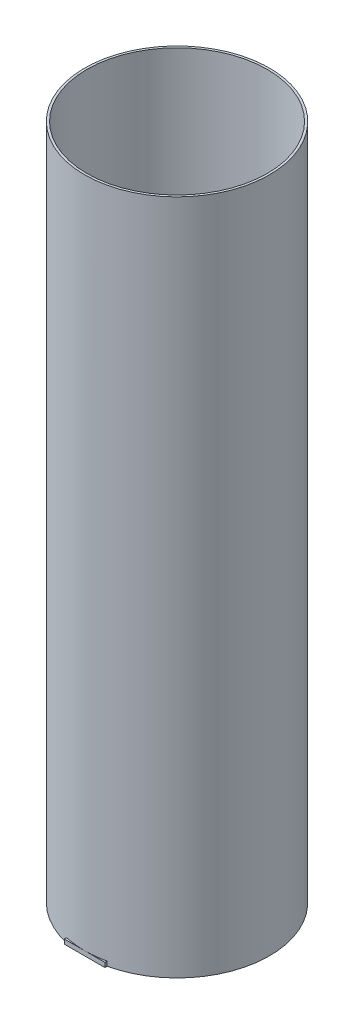
ISO-10303-21;
HEADER;
FILE_DESCRIPTION(('STEP AP214'),'2;1');
FILE_NAME('part.step','',(''),(''),'','','');
FILE_SCHEMA(('AUTOMOTIVE_DESIGN { 1 0 10303 214 1 1 1 1 }'));
ENDSEC;
DATA;
#1=APPLICATION_CONTEXT('core data for automotive mechanical design processes');
#2=APPLICATION_PROTOCOL_DEFINITION('international standard','automotive_design',2000,#1);
#3=PRODUCT_CONTEXT('',#1,'mechanical');
#4=PRODUCT('Part','Part','',(#3));
#5=PRODUCT_RELATED_PRODUCT_CATEGORY('part','',(#4));
#6=PRODUCT_DEFINITION_FORMATION('','',#4);
#7=PRODUCT_DEFINITION_CONTEXT('part definition',#1,'design');
#8=PRODUCT_DEFINITION('design','',#6,#7);
#9=PRODUCT_DEFINITION_SHAPE('','',#8);
#10=(LENGTH_UNIT() NAMED_UNIT(*) SI_UNIT(.MILLI.,.METRE.));
#11=(NAMED_UNIT(*) PLANE_ANGLE_UNIT() SI_UNIT($,.RADIAN.));
#12=(NAMED_UNIT(*) SI_UNIT($,.STERADIAN.) SOLID_ANGLE_UNIT());
#13=UNCERTAINTY_MEASURE_WITH_UNIT(LENGTH_MEASURE(1.E-05),#10,'distance_accuracy_value','');
#14=(GEOMETRIC_REPRESENTATION_CONTEXT(3) GLOBAL_UNCERTAINTY_ASSIGNED_CONTEXT((#13)) GLOBAL_UNIT_ASSIGNED_CONTEXT((#10,
#11,#12)) REPRESENTATION_CONTEXT('',''));
#15=CARTESIAN_POINT('',(0.,0.,0.));
#16=DIRECTION('',(0.,0.,1.));
#17=DIRECTION('',(1.,0.,0.));
#18=AXIS2_PLACEMENT_3D('',#15,#16,#17);
#19=CARTESIAN_POINT('',(0.,381.,0.));
#20=DIRECTION('',(0.,1.,0.));
#21=DIRECTION('',(0.,0.,1.));
#22=AXIS2_PLACEMENT_3D('',#19,#20,#21);
#23=PLANE('',#22);
#24=CARTESIAN_POINT('',(0.,381.,0.));
#25=DIRECTION('',(0.,1.,0.));
#26=DIRECTION('',(0.,0.,1.));
#27=AXIS2_PLACEMENT_3D('',#24,#25,#26);
#28=CIRCLE('',#27,52.07);
#29=CARTESIAN_POINT('',(0.,381.,52.07));
#30=VERTEX_POINT('',#29);
#31=EDGE_CURVE('E11',#30,#30,#28,.T.);
#32=ORIENTED_EDGE('',*,*,#31,.T.);
#33=EDGE_LOOP('',(#32));
#34=FACE_BOUND('',#33,.T.);
#35=CARTESIAN_POINT('',(0.,381.,0.));
#36=DIRECTION('',(0.,1.,0.));
#37=DIRECTION('',(0.,0.,1.));
#38=AXIS2_PLACEMENT_3D('',#35,#36,#37);
#39=CIRCLE('',#38,50.8);
#40=CARTESIAN_POINT('',(0.,381.,50.8));
#41=VERTEX_POINT('',#40);
#42=EDGE_CURVE('E125',#41,#41,#39,.T.);
#43=ORIENTED_EDGE('',*,*,#42,.F.);
#44=EDGE_LOOP('',(#43));
#45=FACE_BOUND('',#44,.T.);
#46=ADVANCED_FACE('F45',(#34,#45),#23,.T.);
#47=CARTESIAN_POINT('',(0.,0.,0.));
#48=DIRECTION('',(0.,1.,0.));
#49=DIRECTION('',(0.,0.,1.));
#50=AXIS2_PLACEMENT_3D('',#47,#48,#49);
#51=PLANE('',#50);
#52=CARTESIAN_POINT('',(0.,0.,0.));
#53=DIRECTION('',(0.,1.,0.));
#54=DIRECTION('',(0.,0.,1.));
#55=AXIS2_PLACEMENT_3D('',#52,#53,#54);
#56=CIRCLE('',#55,50.8);
#57=CARTESIAN_POINT('',(0.,0.,50.8));
#58=VERTEX_POINT('',#57);
#59=EDGE_CURVE('E128',#58,#58,#56,.T.);
#60=ORIENTED_EDGE('',*,*,#59,.T.);
#61=EDGE_LOOP('',(#60));
#62=FACE_BOUND('',#61,.T.);
#63=CARTESIAN_POINT('',(0.,0.,0.));
#64=DIRECTION('',(0.,1.,0.));
#65=DIRECTION('',(0.,0.,1.));
#66=AXIS2_PLACEMENT_3D('',#63,#64,#65);
#67=CIRCLE('',#66,52.07);
#68=CARTESIAN_POINT('',(11.4299999999999,0.,50.8));
#69=VERTEX_POINT('',#68);
#70=CARTESIAN_POINT('',(-11.4299999999999,0.,50.8));
#71=VERTEX_POINT('',#70);
#72=EDGE_CURVE('E49',#69,#71,#67,.T.);
#73=ORIENTED_EDGE('',*,*,#72,.F.);
#74=DIRECTION('',(0.,0.,1.));
#75=VECTOR('',#74,1.);
#76=CARTESIAN_POINT('',(11.4299999999999,0.,0.));
#77=LINE('',#76,#75);
#78=CARTESIAN_POINT('',(11.4299999999999,0.,52.07));
#79=VERTEX_POINT('',#78);
#80=EDGE_CURVE('E117',#69,#79,#77,.T.);
#81=ORIENTED_EDGE('',*,*,#80,.T.);
#82=DIRECTION('',(-1.,0.,0.));
#83=VECTOR('',#82,1.);
#84=CARTESIAN_POINT('',(0.,0.,52.07));
#85=LINE('',#84,#83);
#86=CARTESIAN_POINT('',(-11.4299999999999,0.,52.07));
#87=VERTEX_POINT('',#86);
#88=EDGE_CURVE('E93',#79,#87,#85,.T.);
#89=ORIENTED_EDGE('',*,*,#88,.T.);
#90=DIRECTION('',(0.,0.,-1.));
#91=VECTOR('',#90,1.);
#92=CARTESIAN_POINT('',(-11.4299999999999,0.,0.));
#93=LINE('',#92,#91);
#94=EDGE_CURVE('E110',#87,#71,#93,.T.);
#95=ORIENTED_EDGE('',*,*,#94,.T.);
#96=EDGE_LOOP('',(#73,#81,#89,#95));
#97=FACE_BOUND('',#96,.T.);
#98=ADVANCED_FACE('F132',(#62,#97),#51,.F.);
#99=CARTESIAN_POINT('',(0.,381.,0.));
#100=DIRECTION('',(0.,-1.,0.));
#101=DIRECTION('',(0.,0.,-1.));
#102=AXIS2_PLACEMENT_3D('',#99,#100,#101);
#103=CYLINDRICAL_SURFACE('',#102,52.07);
#104=ORIENTED_EDGE('',*,*,#31,.F.);
#105=EDGE_LOOP('',(#104));
#106=FACE_BOUND('',#105,.T.);
#107=CARTESIAN_POINT('',(0.,2.53999999999999,0.));
#108=DIRECTION('',(0.,-1.,0.));
#109=DIRECTION('',(0.,0.,-1.));
#110=AXIS2_PLACEMENT_3D('',#107,#108,#109);
#111=CIRCLE('',#110,52.07);
#112=CARTESIAN_POINT('',(11.4299999999999,2.53999999999999,50.8));
#113=VERTEX_POINT('',#112);
#114=CARTESIAN_POINT('',(0.,2.53999999999999,52.07));
#115=VERTEX_POINT('',#114);
#116=EDGE_CURVE('E60',#113,#115,#111,.T.);
#117=ORIENTED_EDGE('',*,*,#116,.F.);
#118=DIRECTION('',(0.,-1.,0.));
#119=VECTOR('',#118,1.);
#120=CARTESIAN_POINT('',(11.4299999999999,2.54,50.8));
#121=LINE('',#120,#119);
#122=EDGE_CURVE('E109',#113,#69,#121,.T.);
#123=ORIENTED_EDGE('',*,*,#122,.T.);
#124=ORIENTED_EDGE('',*,*,#72,.T.);
#125=DIRECTION('',(0.,-1.,0.));
#126=VECTOR('',#125,1.);
#127=CARTESIAN_POINT('',(-11.4299999999999,2.54,50.8));
#128=LINE('',#127,#126);
#129=CARTESIAN_POINT('',(-11.4299999999999,2.53999999999999,50.8));
#130=VERTEX_POINT('',#129);
#131=EDGE_CURVE('E66',#130,#71,#128,.T.);
#132=ORIENTED_EDGE('',*,*,#131,.F.);
#133=EDGE_CURVE('E121',#115,#130,#111,.T.);
#134=ORIENTED_EDGE('',*,*,#133,.F.);
#135=EDGE_LOOP('',(#117,#123,#124,#132,#134));
#136=FACE_BOUND('',#135,.T.);
#137=ADVANCED_FACE('F47',(#106,#136),#103,.T.);
#138=CARTESIAN_POINT('',(0.,381.,0.));
#139=DIRECTION('',(0.,-1.,0.));
#140=DIRECTION('',(0.,0.,-1.));
#141=AXIS2_PLACEMENT_3D('',#138,#139,#140);
#142=CYLINDRICAL_SURFACE('',#141,50.8);
#143=ORIENTED_EDGE('',*,*,#59,.F.);
#144=EDGE_LOOP('',(#143));
#145=FACE_BOUND('',#144,.T.);
#146=ORIENTED_EDGE('',*,*,#42,.T.);
#147=EDGE_LOOP('',(#146));
#148=FACE_BOUND('',#147,.T.);
#149=ADVANCED_FACE('F135',(#145,#148),#142,.F.);
#150=CARTESIAN_POINT('',(0.,2.54,52.07));
#151=DIRECTION('',(0.,0.,1.));
#152=DIRECTION('',(1.,0.,0.));
#153=AXIS2_PLACEMENT_3D('',#150,#151,#152);
#154=PLANE('',#153);
#155=DIRECTION('',(0.,-1.,0.));
#156=VECTOR('',#155,1.);
#157=CARTESIAN_POINT('',(-11.4299999999999,2.54,52.07));
#158=LINE('',#157,#156);
#159=CARTESIAN_POINT('',(-11.4299999999999,2.54,52.07));
#160=VERTEX_POINT('',#159);
#161=EDGE_CURVE('E98',#160,#87,#158,.T.);
#162=ORIENTED_EDGE('',*,*,#161,.T.);
#163=ORIENTED_EDGE('',*,*,#88,.F.);
#164=DIRECTION('',(0.,-1.,0.));
#165=VECTOR('',#164,1.);
#166=CARTESIAN_POINT('',(11.4299999999999,2.54,52.07));
#167=LINE('',#166,#165);
#168=CARTESIAN_POINT('',(11.4299999999999,2.54,52.07));
#169=VERTEX_POINT('',#168);
#170=EDGE_CURVE('E88',#169,#79,#167,.T.);
#171=ORIENTED_EDGE('',*,*,#170,.F.);
#172=DIRECTION('',(-1.,0.,0.));
#173=VECTOR('',#172,1.);
#174=CARTESIAN_POINT('',(0.,2.54,52.07));
#175=LINE('',#174,#173);
#176=EDGE_CURVE('E92',#169,#115,#175,.T.);
#177=ORIENTED_EDGE('',*,*,#176,.T.);
#178=EDGE_CURVE('E106',#115,#160,#175,.T.);
#179=ORIENTED_EDGE('',*,*,#178,.T.);
#180=EDGE_LOOP('',(#162,#163,#171,#177,#179));
#181=FACE_BOUND('',#180,.T.);
#182=ADVANCED_FACE('F91',(#181),#154,.T.);
#183=CARTESIAN_POINT('',(0.,2.54,0.));
#184=DIRECTION('',(0.,-1.,0.));
#185=DIRECTION('',(0.,0.,-1.));
#186=AXIS2_PLACEMENT_3D('',#183,#184,#185);
#187=PLANE('',#186);
#188=DIRECTION('',(0.,0.,1.));
#189=VECTOR('',#188,1.);
#190=CARTESIAN_POINT('',(11.4299999999999,2.54,0.));
#191=LINE('',#190,#189);
#192=EDGE_CURVE('E104',#113,#169,#191,.T.);
#193=ORIENTED_EDGE('',*,*,#192,.F.);
#194=ORIENTED_EDGE('',*,*,#116,.T.);
#195=ORIENTED_EDGE('',*,*,#176,.F.);
#196=EDGE_LOOP('',(#193,#194,#195));
#197=FACE_BOUND('',#196,.T.);
#198=ADVANCED_FACE('F103',(#197),#187,.F.);
#199=CARTESIAN_POINT('',(11.4299999999999,2.54,0.));
#200=DIRECTION('',(1.,0.,0.));
#201=DIRECTION('',(0.,0.,-1.));
#202=AXIS2_PLACEMENT_3D('',#199,#200,#201);
#203=PLANE('',#202);
#204=ORIENTED_EDGE('',*,*,#80,.F.);
#205=ORIENTED_EDGE('',*,*,#122,.F.);
#206=ORIENTED_EDGE('',*,*,#192,.T.);
#207=ORIENTED_EDGE('',*,*,#170,.T.);
#208=EDGE_LOOP('',(#204,#205,#206,#207));
#209=FACE_BOUND('',#208,.T.);
#210=ADVANCED_FACE('F108',(#209),#203,.T.);
#211=CARTESIAN_POINT('',(-11.4299999999999,2.54,0.));
#212=DIRECTION('',(-1.,0.,0.));
#213=DIRECTION('',(0.,0.,1.));
#214=AXIS2_PLACEMENT_3D('',#211,#212,#213);
#215=PLANE('',#214);
#216=ORIENTED_EDGE('',*,*,#94,.F.);
#217=ORIENTED_EDGE('',*,*,#161,.F.);
#218=DIRECTION('',(0.,0.,-1.));
#219=VECTOR('',#218,1.);
#220=CARTESIAN_POINT('',(-11.4299999999999,2.54,0.));
#221=LINE('',#220,#219);
#222=EDGE_CURVE('E99',#160,#130,#221,.T.);
#223=ORIENTED_EDGE('',*,*,#222,.T.);
#224=ORIENTED_EDGE('',*,*,#131,.T.);
#225=EDGE_LOOP('',(#216,#217,#223,#224));
#226=FACE_BOUND('',#225,.T.);
#227=ADVANCED_FACE('F151',(#226),#215,.T.);
#228=ORIENTED_EDGE('',*,*,#178,.F.);
#229=ORIENTED_EDGE('',*,*,#133,.T.);
#230=ORIENTED_EDGE('',*,*,#222,.F.);
#231=EDGE_LOOP('',(#228,#229,#230));
#232=FACE_BOUND('',#231,.T.);
#233=ADVANCED_FACE('F156',(#232),#187,.F.);
#234=CLOSED_SHELL('',(#46,#98,#137,#149,#182,#198,#210,#227,#233));
#235=MANIFOLD_SOLID_BREP('B2',#234);
#236=ADVANCED_BREP_SHAPE_REPRESENTATION('',(#18,#235),#14);
#237=SHAPE_DEFINITION_REPRESENTATION(#9,#236);
ENDSEC;
END-ISO-10303-21;
